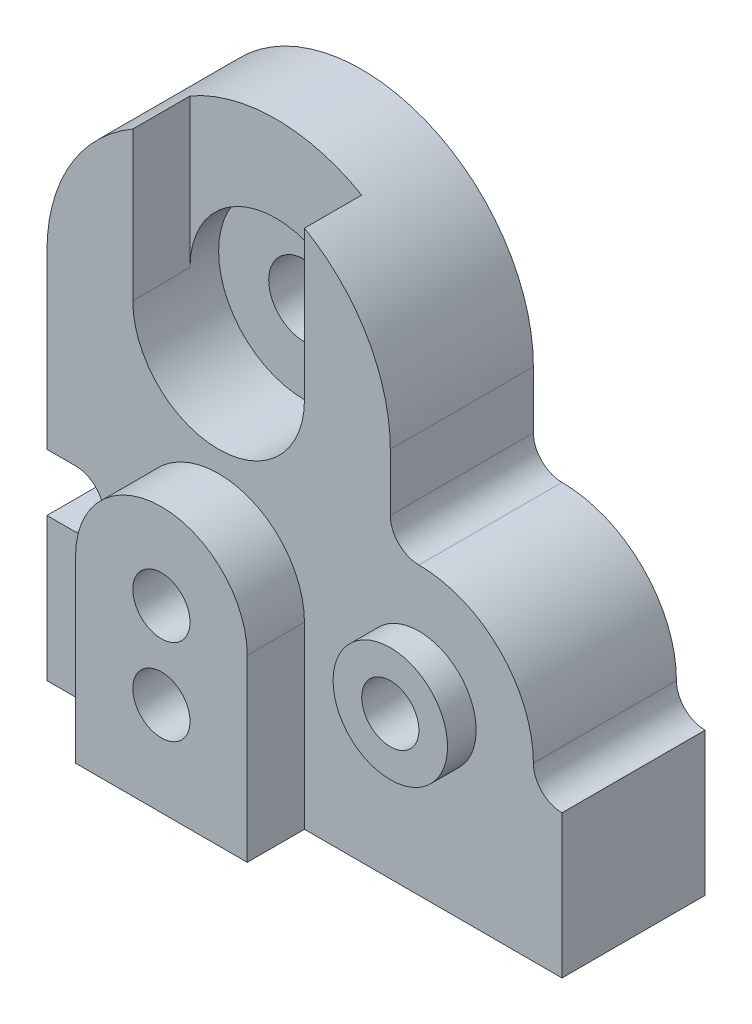
ISO-10303-21;
HEADER;
FILE_DESCRIPTION(('STEP AP214'),'2;1');
FILE_NAME('part.step','',(''),(''),'','','');
FILE_SCHEMA(('AUTOMOTIVE_DESIGN { 1 0 10303 214 1 1 1 1 }'));
ENDSEC;
DATA;
#1=APPLICATION_CONTEXT('core data for automotive mechanical design processes');
#2=APPLICATION_PROTOCOL_DEFINITION('international standard','automotive_design',2000,#1);
#3=PRODUCT_CONTEXT('',#1,'mechanical');
#4=PRODUCT('Part','Part','',(#3));
#5=PRODUCT_RELATED_PRODUCT_CATEGORY('part','',(#4));
#6=PRODUCT_DEFINITION_FORMATION('','',#4);
#7=PRODUCT_DEFINITION_CONTEXT('part definition',#1,'design');
#8=PRODUCT_DEFINITION('design','',#6,#7);
#9=PRODUCT_DEFINITION_SHAPE('','',#8);
#10=(LENGTH_UNIT() NAMED_UNIT(*) SI_UNIT(.MILLI.,.METRE.));
#11=(NAMED_UNIT(*) PLANE_ANGLE_UNIT() SI_UNIT($,.RADIAN.));
#12=(NAMED_UNIT(*) SI_UNIT($,.STERADIAN.) SOLID_ANGLE_UNIT());
#13=UNCERTAINTY_MEASURE_WITH_UNIT(LENGTH_MEASURE(1.E-05),#10,'distance_accuracy_value','');
#14=(GEOMETRIC_REPRESENTATION_CONTEXT(3) GLOBAL_UNCERTAINTY_ASSIGNED_CONTEXT((#13)) GLOBAL_UNIT_ASSIGNED_CONTEXT((#10,
#11,#12)) REPRESENTATION_CONTEXT('',''));
#15=CARTESIAN_POINT('',(0.,0.,0.));
#16=DIRECTION('',(0.,0.,1.));
#17=DIRECTION('',(1.,0.,0.));
#18=AXIS2_PLACEMENT_3D('',#15,#16,#17);
#19=CARTESIAN_POINT('',(6.,13.,5.));
#20=DIRECTION('',(0.,0.,-1.));
#21=DIRECTION('',(-1.,0.,0.));
#22=AXIS2_PLACEMENT_3D('',#19,#20,#21);
#23=CYLINDRICAL_SURFACE('',#22,1.25);
#24=CARTESIAN_POINT('',(6.,13.,-1.));
#25=DIRECTION('',(0.,0.,-1.));
#26=DIRECTION('',(-1.,0.,0.));
#27=AXIS2_PLACEMENT_3D('',#24,#25,#26);
#28=CIRCLE('',#27,1.25000000000001);
#29=CARTESIAN_POINT('',(4.74999999999999,13.,-1.));
#30=VERTEX_POINT('',#29);
#31=EDGE_CURVE('E354',#30,#30,#28,.T.);
#32=ORIENTED_EDGE('',*,*,#31,.T.);
#33=EDGE_LOOP('',(#32));
#34=FACE_BOUND('',#33,.T.);
#35=CARTESIAN_POINT('',(6.,13.,2.));
#36=DIRECTION('',(0.,0.,1.));
#37=DIRECTION('',(1.,0.,0.));
#38=AXIS2_PLACEMENT_3D('',#35,#36,#37);
#39=CIRCLE('',#38,1.25);
#40=CARTESIAN_POINT('',(7.25,13.,2.));
#41=VERTEX_POINT('',#40);
#42=EDGE_CURVE('E39',#41,#41,#39,.T.);
#43=ORIENTED_EDGE('',*,*,#42,.T.);
#44=EDGE_LOOP('',(#43));
#45=FACE_BOUND('',#44,.T.);
#46=ADVANCED_FACE('F35',(#34,#45),#23,.F.);
#47=CARTESIAN_POINT('',(1.,6.,5.));
#48=DIRECTION('',(0.,0.,-1.));
#49=DIRECTION('',(-1.,0.,0.));
#50=AXIS2_PLACEMENT_3D('',#47,#48,#49);
#51=CYLINDRICAL_SURFACE('',#50,0.5);
#52=CARTESIAN_POINT('',(1.,6.,0.));
#53=DIRECTION('',(0.,0.,1.));
#54=DIRECTION('',(1.,0.,0.));
#55=AXIS2_PLACEMENT_3D('',#52,#53,#54);
#56=CIRCLE('',#55,0.5);
#57=CARTESIAN_POINT('',(1.5,6.,0.));
#58=VERTEX_POINT('',#57);
#59=EDGE_CURVE('E222',#58,#58,#56,.T.);
#60=ORIENTED_EDGE('',*,*,#59,.F.);
#61=EDGE_LOOP('',(#60));
#62=FACE_BOUND('',#61,.T.);
#63=CARTESIAN_POINT('',(1.,6.,3.));
#64=DIRECTION('',(0.,0.,1.));
#65=DIRECTION('',(1.,0.,0.));
#66=AXIS2_PLACEMENT_3D('',#63,#64,#65);
#67=CIRCLE('',#66,0.5);
#68=CARTESIAN_POINT('',(1.5,6.,3.));
#69=VERTEX_POINT('',#68);
#70=EDGE_CURVE('E296',#69,#69,#67,.T.);
#71=ORIENTED_EDGE('',*,*,#70,.T.);
#72=EDGE_LOOP('',(#71));
#73=FACE_BOUND('',#72,.T.);
#74=ADVANCED_FACE('F447',(#62,#73),#51,.F.);
#75=CARTESIAN_POINT('',(18.,6.,0.));
#76=DIRECTION('',(0.,0.,-1.));
#77=DIRECTION('',(-1.,0.,0.));
#78=AXIS2_PLACEMENT_3D('',#75,#76,#77);
#79=PLANE('',#78);
#80=CARTESIAN_POINT('',(6.,3.26663723882795,0.));
#81=DIRECTION('',(0.,0.,1.));
#82=DIRECTION('',(1.,0.,0.));
#83=AXIS2_PLACEMENT_3D('',#80,#81,#82);
#84=CIRCLE('',#83,1.);
#85=CARTESIAN_POINT('',(7.,3.26663723882795,0.));
#86=VERTEX_POINT('',#85);
#87=EDGE_CURVE('E185',#86,#86,#84,.T.);
#88=ORIENTED_EDGE('',*,*,#87,.T.);
#89=EDGE_LOOP('',(#88));
#90=FACE_BOUND('',#89,.T.);
#91=DIRECTION('',(0.,-1.,0.));
#92=VECTOR('',#91,1.);
#93=CARTESIAN_POINT('',(0.,13.,0.));
#94=LINE('',#93,#92);
#95=CARTESIAN_POINT('',(0.,13.,0.));
#96=VERTEX_POINT('',#95);
#97=CARTESIAN_POINT('',(0.,0.,0.));
#98=VERTEX_POINT('',#97);
#99=EDGE_CURVE('E225',#96,#98,#94,.T.);
#100=ORIENTED_EDGE('',*,*,#99,.F.);
#101=CARTESIAN_POINT('',(6.,13.,0.));
#102=DIRECTION('',(0.,0.,1.));
#103=DIRECTION('',(1.,0.,0.));
#104=AXIS2_PLACEMENT_3D('',#101,#102,#103);
#105=CIRCLE('',#104,6.);
#106=CARTESIAN_POINT('',(12.,13.,0.));
#107=VERTEX_POINT('',#106);
#108=EDGE_CURVE('E262',#107,#96,#105,.T.);
#109=ORIENTED_EDGE('',*,*,#108,.F.);
#110=DIRECTION('',(0.,1.,0.));
#111=VECTOR('',#110,1.);
#112=CARTESIAN_POINT('',(12.,11.,0.));
#113=LINE('',#112,#111);
#114=CARTESIAN_POINT('',(12.,11.,0.));
#115=VERTEX_POINT('',#114);
#116=EDGE_CURVE('E260',#115,#107,#113,.T.);
#117=ORIENTED_EDGE('',*,*,#116,.F.);
#118=CARTESIAN_POINT('',(13.,11.,0.));
#119=DIRECTION('',(0.,0.,-1.));
#120=DIRECTION('',(-1.,0.,0.));
#121=AXIS2_PLACEMENT_3D('',#118,#119,#120);
#122=CIRCLE('',#121,1.);
#123=CARTESIAN_POINT('',(13.,10.,0.));
#124=VERTEX_POINT('',#123);
#125=EDGE_CURVE('E258',#124,#115,#122,.T.);
#126=ORIENTED_EDGE('',*,*,#125,.F.);
#127=CARTESIAN_POINT('',(13.,6.,0.));
#128=DIRECTION('',(0.,0.,1.));
#129=DIRECTION('',(1.,0.,0.));
#130=AXIS2_PLACEMENT_3D('',#127,#128,#129);
#131=CIRCLE('',#130,4.);
#132=CARTESIAN_POINT('',(17.,6.,0.));
#133=VERTEX_POINT('',#132);
#134=EDGE_CURVE('E256',#133,#124,#131,.T.);
#135=ORIENTED_EDGE('',*,*,#134,.F.);
#136=CARTESIAN_POINT('',(18.,6.,0.));
#137=DIRECTION('',(0.,0.,-1.));
#138=DIRECTION('',(-1.,0.,0.));
#139=AXIS2_PLACEMENT_3D('',#136,#137,#138);
#140=CIRCLE('',#139,1.);
#141=CARTESIAN_POINT('',(18.,5.,0.));
#142=VERTEX_POINT('',#141);
#143=EDGE_CURVE('E254',#142,#133,#140,.T.);
#144=ORIENTED_EDGE('',*,*,#143,.F.);
#145=DIRECTION('',(0.,1.,0.));
#146=VECTOR('',#145,1.);
#147=CARTESIAN_POINT('',(18.,0.,0.));
#148=LINE('',#147,#146);
#149=CARTESIAN_POINT('',(18.,0.,0.));
#150=VERTEX_POINT('',#149);
#151=EDGE_CURVE('E252',#150,#142,#148,.T.);
#152=ORIENTED_EDGE('',*,*,#151,.F.);
#153=DIRECTION('',(1.,0.,0.));
#154=VECTOR('',#153,1.);
#155=CARTESIAN_POINT('',(0.,0.,0.));
#156=LINE('',#155,#154);
#157=EDGE_CURVE('E250',#98,#150,#156,.T.);
#158=ORIENTED_EDGE('',*,*,#157,.F.);
#159=EDGE_LOOP('',(#100,#109,#117,#126,#135,#144,#152,#158));
#160=FACE_BOUND('',#159,.T.);
#161=ORIENTED_EDGE('',*,*,#59,.T.);
#162=EDGE_LOOP('',(#161));
#163=FACE_BOUND('',#162,.T.);
#164=CARTESIAN_POINT('',(13.,6.,0.));
#165=DIRECTION('',(0.,0.,-1.));
#166=DIRECTION('',(-1.,0.,0.));
#167=AXIS2_PLACEMENT_3D('',#164,#165,#166);
#168=CIRCLE('',#167,2.);
#169=CARTESIAN_POINT('',(11.,6.,0.));
#170=VERTEX_POINT('',#169);
#171=EDGE_CURVE('E215',#170,#170,#168,.T.);
#172=ORIENTED_EDGE('',*,*,#171,.F.);
#173=EDGE_LOOP('',(#172));
#174=FACE_BOUND('',#173,.T.);
#175=CARTESIAN_POINT('',(6.,13.,0.));
#176=DIRECTION('',(0.,0.,-1.));
#177=DIRECTION('',(-1.,0.,0.));
#178=AXIS2_PLACEMENT_3D('',#175,#176,#177);
#179=CIRCLE('',#178,3.);
#180=CARTESIAN_POINT('',(3.,13.,0.));
#181=VERTEX_POINT('',#180);
#182=EDGE_CURVE('E362',#181,#181,#179,.T.);
#183=ORIENTED_EDGE('',*,*,#182,.F.);
#184=EDGE_LOOP('',(#183));
#185=FACE_BOUND('',#184,.T.);
#186=ADVANCED_FACE('F321',(#90,#160,#163,#174,#185),#79,.T.);
#187=CARTESIAN_POINT('',(18.,6.,5.));
#188=DIRECTION('',(0.,0.,-1.));
#189=DIRECTION('',(-1.,0.,0.));
#190=AXIS2_PLACEMENT_3D('',#187,#188,#189);
#191=PLANE('',#190);
#192=CARTESIAN_POINT('',(1.,6.,5.));
#193=DIRECTION('',(0.,0.,1.));
#194=DIRECTION('',(1.,0.,0.));
#195=AXIS2_PLACEMENT_3D('',#192,#193,#194);
#196=CIRCLE('',#195,1.);
#197=CARTESIAN_POINT('',(1.,5.,5.));
#198=VERTEX_POINT('',#197);
#199=CARTESIAN_POINT('',(1.,7.,5.));
#200=VERTEX_POINT('',#199);
#201=EDGE_CURVE('E335',#198,#200,#196,.T.);
#202=ORIENTED_EDGE('',*,*,#201,.F.);
#203=DIRECTION('',(1.,0.,0.));
#204=VECTOR('',#203,1.);
#205=CARTESIAN_POINT('',(1.,5.,5.));
#206=LINE('',#205,#204);
#207=CARTESIAN_POINT('',(0.,5.,5.));
#208=VERTEX_POINT('',#207);
#209=EDGE_CURVE('E333',#208,#198,#206,.T.);
#210=ORIENTED_EDGE('',*,*,#209,.F.);
#211=DIRECTION('',(0.,-1.,0.));
#212=VECTOR('',#211,1.);
#213=CARTESIAN_POINT('',(0.,13.,5.));
#214=LINE('',#213,#212);
#215=CARTESIAN_POINT('',(0.,0.,5.));
#216=VERTEX_POINT('',#215);
#217=EDGE_CURVE('E230',#208,#216,#214,.T.);
#218=ORIENTED_EDGE('',*,*,#217,.T.);
#219=DIRECTION('',(1.,0.,0.));
#220=VECTOR('',#219,1.);
#221=CARTESIAN_POINT('',(0.,0.,5.));
#222=LINE('',#221,#220);
#223=CARTESIAN_POINT('',(3.,0.,5.));
#224=VERTEX_POINT('',#223);
#225=EDGE_CURVE('E231',#216,#224,#222,.T.);
#226=ORIENTED_EDGE('',*,*,#225,.T.);
#227=DIRECTION('',(0.,-1.,0.));
#228=VECTOR('',#227,1.);
#229=CARTESIAN_POINT('',(3.,6.26663723882795,5.));
#230=LINE('',#229,#228);
#231=CARTESIAN_POINT('',(3.,6.26663723882795,5.));
#232=VERTEX_POINT('',#231);
#233=EDGE_CURVE('E386',#232,#224,#230,.T.);
#234=ORIENTED_EDGE('',*,*,#233,.F.);
#235=CARTESIAN_POINT('',(6.,6.26663723882795,5.));
#236=DIRECTION('',(0.,0.,1.));
#237=DIRECTION('',(1.,0.,0.));
#238=AXIS2_PLACEMENT_3D('',#235,#236,#237);
#239=CIRCLE('',#238,3.);
#240=CARTESIAN_POINT('',(9.,6.26663723882795,5.));
#241=VERTEX_POINT('',#240);
#242=EDGE_CURVE('E59',#241,#232,#239,.T.);
#243=ORIENTED_EDGE('',*,*,#242,.F.);
#244=DIRECTION('',(0.,1.,0.));
#245=VECTOR('',#244,1.);
#246=CARTESIAN_POINT('',(9.,6.26663723882795,5.));
#247=LINE('',#246,#245);
#248=CARTESIAN_POINT('',(9.,0.,5.));
#249=VERTEX_POINT('',#248);
#250=EDGE_CURVE('E378',#249,#241,#247,.T.);
#251=ORIENTED_EDGE('',*,*,#250,.F.);
#252=CARTESIAN_POINT('',(18.,0.,5.));
#253=VERTEX_POINT('',#252);
#254=EDGE_CURVE('E229',#249,#253,#222,.T.);
#255=ORIENTED_EDGE('',*,*,#254,.T.);
#256=DIRECTION('',(0.,1.,0.));
#257=VECTOR('',#256,1.);
#258=CARTESIAN_POINT('',(18.,0.,5.));
#259=LINE('',#258,#257);
#260=CARTESIAN_POINT('',(18.,5.,5.));
#261=VERTEX_POINT('',#260);
#262=EDGE_CURVE('E233',#253,#261,#259,.T.);
#263=ORIENTED_EDGE('',*,*,#262,.T.);
#264=CARTESIAN_POINT('',(18.,6.,5.));
#265=DIRECTION('',(0.,0.,-1.));
#266=DIRECTION('',(-1.,0.,0.));
#267=AXIS2_PLACEMENT_3D('',#264,#265,#266);
#268=CIRCLE('',#267,1.);
#269=CARTESIAN_POINT('',(17.,6.,5.));
#270=VERTEX_POINT('',#269);
#271=EDGE_CURVE('E235',#261,#270,#268,.T.);
#272=ORIENTED_EDGE('',*,*,#271,.T.);
#273=CARTESIAN_POINT('',(13.,6.,5.));
#274=DIRECTION('',(0.,0.,1.));
#275=DIRECTION('',(1.,0.,0.));
#276=AXIS2_PLACEMENT_3D('',#273,#274,#275);
#277=CIRCLE('',#276,4.);
#278=CARTESIAN_POINT('',(13.,10.,5.));
#279=VERTEX_POINT('',#278);
#280=EDGE_CURVE('E237',#270,#279,#277,.T.);
#281=ORIENTED_EDGE('',*,*,#280,.T.);
#282=CARTESIAN_POINT('',(13.,11.,5.));
#283=DIRECTION('',(0.,0.,-1.));
#284=DIRECTION('',(-1.,0.,0.));
#285=AXIS2_PLACEMENT_3D('',#282,#283,#284);
#286=CIRCLE('',#285,1.);
#287=CARTESIAN_POINT('',(12.,11.,5.));
#288=VERTEX_POINT('',#287);
#289=EDGE_CURVE('E239',#279,#288,#286,.T.);
#290=ORIENTED_EDGE('',*,*,#289,.T.);
#291=DIRECTION('',(0.,1.,0.));
#292=VECTOR('',#291,1.);
#293=CARTESIAN_POINT('',(12.,11.,5.));
#294=LINE('',#293,#292);
#295=CARTESIAN_POINT('',(12.,13.,5.));
#296=VERTEX_POINT('',#295);
#297=EDGE_CURVE('E241',#288,#296,#294,.T.);
#298=ORIENTED_EDGE('',*,*,#297,.T.);
#299=CARTESIAN_POINT('',(6.,13.,5.));
#300=DIRECTION('',(0.,0.,1.));
#301=DIRECTION('',(1.,0.,0.));
#302=AXIS2_PLACEMENT_3D('',#299,#300,#301);
#303=CIRCLE('',#302,6.);
#304=CARTESIAN_POINT('',(9.,18.1961524227066,5.));
#305=VERTEX_POINT('',#304);
#306=EDGE_CURVE('E244',#296,#305,#303,.T.);
#307=ORIENTED_EDGE('',*,*,#306,.T.);
#308=DIRECTION('',(0.,1.,0.));
#309=VECTOR('',#308,1.);
#310=CARTESIAN_POINT('',(9.,13.,5.));
#311=LINE('',#310,#309);
#312=CARTESIAN_POINT('',(9.,13.,5.));
#313=VERTEX_POINT('',#312);
#314=EDGE_CURVE('E204',#313,#305,#311,.T.);
#315=ORIENTED_EDGE('',*,*,#314,.F.);
#316=CARTESIAN_POINT('',(6.,13.,5.));
#317=DIRECTION('',(0.,0.,1.));
#318=DIRECTION('',(1.,0.,0.));
#319=AXIS2_PLACEMENT_3D('',#316,#317,#318);
#320=CIRCLE('',#319,3.);
#321=CARTESIAN_POINT('',(3.,13.,5.));
#322=VERTEX_POINT('',#321);
#323=EDGE_CURVE('E192',#322,#313,#320,.T.);
#324=ORIENTED_EDGE('',*,*,#323,.F.);
#325=DIRECTION('',(0.,-1.,0.));
#326=VECTOR('',#325,1.);
#327=CARTESIAN_POINT('',(3.,13.,5.));
#328=LINE('',#327,#326);
#329=CARTESIAN_POINT('',(3.,18.1961524227066,5.));
#330=VERTEX_POINT('',#329);
#331=EDGE_CURVE('E201',#330,#322,#328,.T.);
#332=ORIENTED_EDGE('',*,*,#331,.F.);
#333=CARTESIAN_POINT('',(0.,13.,5.));
#334=VERTEX_POINT('',#333);
#335=EDGE_CURVE('E243',#330,#334,#303,.T.);
#336=ORIENTED_EDGE('',*,*,#335,.T.);
#337=CARTESIAN_POINT('',(0.,7.,5.));
#338=VERTEX_POINT('',#337);
#339=EDGE_CURVE('E226',#334,#338,#214,.T.);
#340=ORIENTED_EDGE('',*,*,#339,.T.);
#341=DIRECTION('',(-1.,0.,0.));
#342=VECTOR('',#341,1.);
#343=CARTESIAN_POINT('',(1.,7.,5.));
#344=LINE('',#343,#342);
#345=EDGE_CURVE('E311',#200,#338,#344,.T.);
#346=ORIENTED_EDGE('',*,*,#345,.F.);
#347=EDGE_LOOP('',(#202,#210,#218,#226,#234,#243,#251,#255,#263,#272,#281,#290,#298,#307,#315,
#324,#332,#336,#340,#346));
#348=FACE_BOUND('',#347,.T.);
#349=CARTESIAN_POINT('',(13.,6.,5.));
#350=DIRECTION('',(0.,0.,-1.));
#351=DIRECTION('',(-1.,0.,0.));
#352=AXIS2_PLACEMENT_3D('',#349,#350,#351);
#353=CIRCLE('',#352,2.);
#354=CARTESIAN_POINT('',(11.,6.,5.));
#355=VERTEX_POINT('',#354);
#356=EDGE_CURVE('E293',#355,#355,#353,.F.);
#357=ORIENTED_EDGE('',*,*,#356,.F.);
#358=EDGE_LOOP('',(#357));
#359=FACE_BOUND('',#358,.T.);
#360=ADVANCED_FACE('F309',(#348,#359),#191,.F.);
#361=CARTESIAN_POINT('',(13.,6.,5.));
#362=DIRECTION('',(0.,0.,-1.));
#363=DIRECTION('',(-1.,0.,0.));
#364=AXIS2_PLACEMENT_3D('',#361,#362,#363);
#365=CYLINDRICAL_SURFACE('',#364,1.);
#366=CARTESIAN_POINT('',(13.,6.,2.));
#367=DIRECTION('',(0.,0.,-1.));
#368=DIRECTION('',(-1.,0.,0.));
#369=AXIS2_PLACEMENT_3D('',#366,#367,#368);
#370=CIRCLE('',#369,1.);
#371=CARTESIAN_POINT('',(12.,6.,2.));
#372=VERTEX_POINT('',#371);
#373=EDGE_CURVE('E219',#372,#372,#370,.T.);
#374=ORIENTED_EDGE('',*,*,#373,.T.);
#375=EDGE_LOOP('',(#374));
#376=FACE_BOUND('',#375,.T.);
#377=CARTESIAN_POINT('',(13.,6.,6.));
#378=DIRECTION('',(0.,0.,1.));
#379=DIRECTION('',(1.,0.,0.));
#380=AXIS2_PLACEMENT_3D('',#377,#378,#379);
#381=CIRCLE('',#380,0.999999999999998);
#382=CARTESIAN_POINT('',(14.,6.,6.));
#383=VERTEX_POINT('',#382);
#384=EDGE_CURVE('E366',#383,#383,#381,.T.);
#385=ORIENTED_EDGE('',*,*,#384,.T.);
#386=EDGE_LOOP('',(#385));
#387=FACE_BOUND('',#386,.T.);
#388=ADVANCED_FACE('F460',(#376,#387),#365,.F.);
#389=CARTESIAN_POINT('',(0.,13.,5.));
#390=DIRECTION('',(1.,0.,0.));
#391=DIRECTION('',(0.,1.,0.));
#392=AXIS2_PLACEMENT_3D('',#389,#390,#391);
#393=PLANE('',#392);
#394=ORIENTED_EDGE('',*,*,#217,.F.);
#395=DIRECTION('',(0.,0.,-1.));
#396=VECTOR('',#395,1.);
#397=CARTESIAN_POINT('',(0.,5.,5.));
#398=LINE('',#397,#396);
#399=CARTESIAN_POINT('',(0.,5.,3.));
#400=VERTEX_POINT('',#399);
#401=EDGE_CURVE('E11',#208,#400,#398,.T.);
#402=ORIENTED_EDGE('',*,*,#401,.T.);
#403=DIRECTION('',(0.,-1.,0.));
#404=VECTOR('',#403,1.);
#405=CARTESIAN_POINT('',(0.,13.,3.));
#406=LINE('',#405,#404);
#407=CARTESIAN_POINT('',(0.,7.,3.));
#408=VERTEX_POINT('',#407);
#409=EDGE_CURVE('E299',#408,#400,#406,.T.);
#410=ORIENTED_EDGE('',*,*,#409,.F.);
#411=DIRECTION('',(0.,0.,1.));
#412=VECTOR('',#411,1.);
#413=CARTESIAN_POINT('',(0.,7.,5.));
#414=LINE('',#413,#412);
#415=EDGE_CURVE('E44',#408,#338,#414,.T.);
#416=ORIENTED_EDGE('',*,*,#415,.T.);
#417=ORIENTED_EDGE('',*,*,#339,.F.);
#418=DIRECTION('',(0.,0.,-1.));
#419=VECTOR('',#418,1.);
#420=CARTESIAN_POINT('',(0.,13.,5.));
#421=LINE('',#420,#419);
#422=EDGE_CURVE('E247',#334,#96,#421,.T.);
#423=ORIENTED_EDGE('',*,*,#422,.T.);
#424=ORIENTED_EDGE('',*,*,#99,.T.);
#425=DIRECTION('',(0.,0.,-1.));
#426=VECTOR('',#425,1.);
#427=CARTESIAN_POINT('',(0.,0.,5.));
#428=LINE('',#427,#426);
#429=EDGE_CURVE('E284',#216,#98,#428,.T.);
#430=ORIENTED_EDGE('',*,*,#429,.F.);
#431=EDGE_LOOP('',(#394,#402,#410,#416,#417,#423,#424,#430));
#432=FACE_BOUND('',#431,.T.);
#433=ADVANCED_FACE('F37',(#432),#393,.F.);
#434=CARTESIAN_POINT('',(0.,0.,5.));
#435=DIRECTION('',(0.,1.,0.));
#436=DIRECTION('',(0.,0.,1.));
#437=AXIS2_PLACEMENT_3D('',#434,#435,#436);
#438=PLANE('',#437);
#439=ORIENTED_EDGE('',*,*,#157,.T.);
#440=DIRECTION('',(0.,0.,-1.));
#441=VECTOR('',#440,1.);
#442=CARTESIAN_POINT('',(18.,0.,5.));
#443=LINE('',#442,#441);
#444=EDGE_CURVE('E281',#253,#150,#443,.T.);
#445=ORIENTED_EDGE('',*,*,#444,.F.);
#446=ORIENTED_EDGE('',*,*,#254,.F.);
#447=DIRECTION('',(0.,0.,-1.));
#448=VECTOR('',#447,1.);
#449=CARTESIAN_POINT('',(9.,0.,7.));
#450=LINE('',#449,#448);
#451=CARTESIAN_POINT('',(9.,0.,7.));
#452=VERTEX_POINT('',#451);
#453=EDGE_CURVE('E391',#452,#249,#450,.T.);
#454=ORIENTED_EDGE('',*,*,#453,.F.);
#455=DIRECTION('',(1.,0.,0.));
#456=VECTOR('',#455,1.);
#457=CARTESIAN_POINT('',(3.,0.,7.));
#458=LINE('',#457,#456);
#459=CARTESIAN_POINT('',(3.,0.,7.));
#460=VERTEX_POINT('',#459);
#461=EDGE_CURVE('E380',#460,#452,#458,.T.);
#462=ORIENTED_EDGE('',*,*,#461,.F.);
#463=DIRECTION('',(0.,0.,-1.));
#464=VECTOR('',#463,1.);
#465=CARTESIAN_POINT('',(3.,0.,7.));
#466=LINE('',#465,#464);
#467=EDGE_CURVE('E393',#460,#224,#466,.T.);
#468=ORIENTED_EDGE('',*,*,#467,.T.);
#469=ORIENTED_EDGE('',*,*,#225,.F.);
#470=ORIENTED_EDGE('',*,*,#429,.T.);
#471=EDGE_LOOP('',(#439,#445,#446,#454,#462,#468,#469,#470));
#472=FACE_BOUND('',#471,.T.);
#473=ADVANCED_FACE('F329',(#472),#438,.F.);
#474=CARTESIAN_POINT('',(18.,0.,5.));
#475=DIRECTION('',(-1.,0.,0.));
#476=DIRECTION('',(0.,0.,1.));
#477=AXIS2_PLACEMENT_3D('',#474,#475,#476);
#478=PLANE('',#477);
#479=ORIENTED_EDGE('',*,*,#151,.T.);
#480=DIRECTION('',(0.,0.,-1.));
#481=VECTOR('',#480,1.);
#482=CARTESIAN_POINT('',(18.,5.,5.));
#483=LINE('',#482,#481);
#484=EDGE_CURVE('E278',#261,#142,#483,.T.);
#485=ORIENTED_EDGE('',*,*,#484,.F.);
#486=ORIENTED_EDGE('',*,*,#262,.F.);
#487=ORIENTED_EDGE('',*,*,#444,.T.);
#488=EDGE_LOOP('',(#479,#485,#486,#487));
#489=FACE_BOUND('',#488,.T.);
#490=ADVANCED_FACE('F412',(#489),#478,.F.);
#491=CARTESIAN_POINT('',(18.,6.,5.));
#492=DIRECTION('',(0.,0.,-1.));
#493=DIRECTION('',(-1.,0.,0.));
#494=AXIS2_PLACEMENT_3D('',#491,#492,#493);
#495=CYLINDRICAL_SURFACE('',#494,1.);
#496=ORIENTED_EDGE('',*,*,#143,.T.);
#497=DIRECTION('',(0.,0.,-1.));
#498=VECTOR('',#497,1.);
#499=CARTESIAN_POINT('',(17.,6.,5.));
#500=LINE('',#499,#498);
#501=EDGE_CURVE('E275',#270,#133,#500,.T.);
#502=ORIENTED_EDGE('',*,*,#501,.F.);
#503=ORIENTED_EDGE('',*,*,#271,.F.);
#504=ORIENTED_EDGE('',*,*,#484,.T.);
#505=EDGE_LOOP('',(#496,#502,#503,#504));
#506=FACE_BOUND('',#505,.T.);
#507=ADVANCED_FACE('F418',(#506),#495,.F.);
#508=CARTESIAN_POINT('',(13.,6.,5.));
#509=DIRECTION('',(0.,0.,-1.));
#510=DIRECTION('',(-1.,0.,0.));
#511=AXIS2_PLACEMENT_3D('',#508,#509,#510);
#512=CYLINDRICAL_SURFACE('',#511,4.);
#513=ORIENTED_EDGE('',*,*,#134,.T.);
#514=DIRECTION('',(0.,0.,-1.));
#515=VECTOR('',#514,1.);
#516=CARTESIAN_POINT('',(13.,10.,5.));
#517=LINE('',#516,#515);
#518=EDGE_CURVE('E272',#279,#124,#517,.T.);
#519=ORIENTED_EDGE('',*,*,#518,.F.);
#520=ORIENTED_EDGE('',*,*,#280,.F.);
#521=ORIENTED_EDGE('',*,*,#501,.T.);
#522=EDGE_LOOP('',(#513,#519,#520,#521));
#523=FACE_BOUND('',#522,.T.);
#524=ADVANCED_FACE('F421',(#523),#512,.T.);
#525=CARTESIAN_POINT('',(13.,11.,5.));
#526=DIRECTION('',(0.,0.,-1.));
#527=DIRECTION('',(-1.,0.,0.));
#528=AXIS2_PLACEMENT_3D('',#525,#526,#527);
#529=CYLINDRICAL_SURFACE('',#528,1.);
#530=ORIENTED_EDGE('',*,*,#125,.T.);
#531=DIRECTION('',(0.,0.,-1.));
#532=VECTOR('',#531,1.);
#533=CARTESIAN_POINT('',(12.,11.,5.));
#534=LINE('',#533,#532);
#535=EDGE_CURVE('E269',#288,#115,#534,.T.);
#536=ORIENTED_EDGE('',*,*,#535,.F.);
#537=ORIENTED_EDGE('',*,*,#289,.F.);
#538=ORIENTED_EDGE('',*,*,#518,.T.);
#539=EDGE_LOOP('',(#530,#536,#537,#538));
#540=FACE_BOUND('',#539,.T.);
#541=ADVANCED_FACE('F426',(#540),#529,.F.);
#542=CARTESIAN_POINT('',(12.,11.,5.));
#543=DIRECTION('',(-1.,0.,0.));
#544=DIRECTION('',(0.,0.,1.));
#545=AXIS2_PLACEMENT_3D('',#542,#543,#544);
#546=PLANE('',#545);
#547=ORIENTED_EDGE('',*,*,#116,.T.);
#548=DIRECTION('',(0.,0.,-1.));
#549=VECTOR('',#548,1.);
#550=CARTESIAN_POINT('',(12.,13.,5.));
#551=LINE('',#550,#549);
#552=EDGE_CURVE('E266',#296,#107,#551,.T.);
#553=ORIENTED_EDGE('',*,*,#552,.F.);
#554=ORIENTED_EDGE('',*,*,#297,.F.);
#555=ORIENTED_EDGE('',*,*,#535,.T.);
#556=EDGE_LOOP('',(#547,#553,#554,#555));
#557=FACE_BOUND('',#556,.T.);
#558=ADVANCED_FACE('F431',(#557),#546,.F.);
#559=CARTESIAN_POINT('',(6.,13.,5.));
#560=DIRECTION('',(0.,0.,-1.));
#561=DIRECTION('',(-1.,0.,0.));
#562=AXIS2_PLACEMENT_3D('',#559,#560,#561);
#563=CYLINDRICAL_SURFACE('',#562,6.);
#564=ORIENTED_EDGE('',*,*,#335,.F.);
#565=DIRECTION('',(0.,0.,-1.));
#566=VECTOR('',#565,1.);
#567=CARTESIAN_POINT('',(3.,18.1961524227066,5.));
#568=LINE('',#567,#566);
#569=CARTESIAN_POINT('',(3.,18.1961524227066,3.));
#570=VERTEX_POINT('',#569);
#571=EDGE_CURVE('E290',#330,#570,#568,.T.);
#572=ORIENTED_EDGE('',*,*,#571,.T.);
#573=CARTESIAN_POINT('',(6.,13.,3.));
#574=DIRECTION('',(0.,0.,1.));
#575=DIRECTION('',(1.,0.,0.));
#576=AXIS2_PLACEMENT_3D('',#573,#574,#575);
#577=CIRCLE('',#576,6.);
#578=CARTESIAN_POINT('',(9.,18.1961524227066,3.));
#579=VERTEX_POINT('',#578);
#580=EDGE_CURVE('E212',#579,#570,#577,.T.);
#581=ORIENTED_EDGE('',*,*,#580,.F.);
#582=DIRECTION('',(0.,0.,-1.));
#583=VECTOR('',#582,1.);
#584=CARTESIAN_POINT('',(9.,18.1961524227066,5.));
#585=LINE('',#584,#583);
#586=EDGE_CURVE('E199',#579,#305,#585,.F.);
#587=ORIENTED_EDGE('',*,*,#586,.T.);
#588=ORIENTED_EDGE('',*,*,#306,.F.);
#589=ORIENTED_EDGE('',*,*,#552,.T.);
#590=ORIENTED_EDGE('',*,*,#108,.T.);
#591=ORIENTED_EDGE('',*,*,#422,.F.);
#592=EDGE_LOOP('',(#564,#572,#581,#587,#588,#589,#590,#591));
#593=FACE_BOUND('',#592,.T.);
#594=ADVANCED_FACE('F316',(#593),#563,.T.);
#595=CARTESIAN_POINT('',(13.,6.,2.));
#596=DIRECTION('',(0.,0.,-1.));
#597=DIRECTION('',(-1.,0.,0.));
#598=AXIS2_PLACEMENT_3D('',#595,#596,#597);
#599=CYLINDRICAL_SURFACE('',#598,2.);
#600=CARTESIAN_POINT('',(13.,6.,2.));
#601=DIRECTION('',(0.,0.,-1.));
#602=DIRECTION('',(-1.,0.,0.));
#603=AXIS2_PLACEMENT_3D('',#600,#601,#602);
#604=CIRCLE('',#603,2.);
#605=CARTESIAN_POINT('',(11.,6.,2.));
#606=VERTEX_POINT('',#605);
#607=EDGE_CURVE('E216',#606,#606,#604,.T.);
#608=ORIENTED_EDGE('',*,*,#607,.F.);
#609=EDGE_LOOP('',(#608));
#610=FACE_BOUND('',#609,.T.);
#611=ORIENTED_EDGE('',*,*,#171,.T.);
#612=EDGE_LOOP('',(#611));
#613=FACE_BOUND('',#612,.T.);
#614=ADVANCED_FACE('F442',(#610,#613),#599,.F.);
#615=CARTESIAN_POINT('',(13.,6.,2.));
#616=DIRECTION('',(0.,0.,-1.));
#617=DIRECTION('',(-1.,0.,0.));
#618=AXIS2_PLACEMENT_3D('',#615,#616,#617);
#619=PLANE('',#618);
#620=ORIENTED_EDGE('',*,*,#373,.F.);
#621=EDGE_LOOP('',(#620));
#622=FACE_BOUND('',#621,.T.);
#623=ORIENTED_EDGE('',*,*,#607,.T.);
#624=EDGE_LOOP('',(#623));
#625=FACE_BOUND('',#624,.T.);
#626=ADVANCED_FACE('F435',(#622,#625),#619,.T.);
#627=CARTESIAN_POINT('',(3.,13.,3.));
#628=DIRECTION('',(-1.,0.,0.));
#629=DIRECTION('',(0.,0.,1.));
#630=AXIS2_PLACEMENT_3D('',#627,#628,#629);
#631=PLANE('',#630);
#632=ORIENTED_EDGE('',*,*,#331,.T.);
#633=DIRECTION('',(0.,0.,1.));
#634=VECTOR('',#633,1.);
#635=CARTESIAN_POINT('',(3.,13.,3.));
#636=LINE('',#635,#634);
#637=CARTESIAN_POINT('',(3.,13.,3.));
#638=VERTEX_POINT('',#637);
#639=EDGE_CURVE('E195',#638,#322,#636,.T.);
#640=ORIENTED_EDGE('',*,*,#639,.F.);
#641=DIRECTION('',(0.,-1.,0.));
#642=VECTOR('',#641,1.);
#643=CARTESIAN_POINT('',(3.,13.,3.));
#644=LINE('',#643,#642);
#645=EDGE_CURVE('E180',#570,#638,#644,.T.);
#646=ORIENTED_EDGE('',*,*,#645,.F.);
#647=ORIENTED_EDGE('',*,*,#571,.F.);
#648=EDGE_LOOP('',(#632,#640,#646,#647));
#649=FACE_BOUND('',#648,.T.);
#650=ADVANCED_FACE('F433',(#649),#631,.F.);
#651=CARTESIAN_POINT('',(9.,13.,3.));
#652=DIRECTION('',(1.,0.,0.));
#653=DIRECTION('',(0.,0.,-1.));
#654=AXIS2_PLACEMENT_3D('',#651,#652,#653);
#655=PLANE('',#654);
#656=DIRECTION('',(0.,1.,0.));
#657=VECTOR('',#656,1.);
#658=CARTESIAN_POINT('',(9.,13.,3.));
#659=LINE('',#658,#657);
#660=CARTESIAN_POINT('',(9.,13.,3.));
#661=VERTEX_POINT('',#660);
#662=EDGE_CURVE('E177',#661,#579,#659,.T.);
#663=ORIENTED_EDGE('',*,*,#662,.F.);
#664=DIRECTION('',(0.,0.,1.));
#665=VECTOR('',#664,1.);
#666=CARTESIAN_POINT('',(9.,13.,3.));
#667=LINE('',#666,#665);
#668=EDGE_CURVE('E188',#661,#313,#667,.T.);
#669=ORIENTED_EDGE('',*,*,#668,.T.);
#670=ORIENTED_EDGE('',*,*,#314,.T.);
#671=ORIENTED_EDGE('',*,*,#586,.F.);
#672=EDGE_LOOP('',(#663,#669,#670,#671));
#673=FACE_BOUND('',#672,.T.);
#674=ADVANCED_FACE('F197',(#673),#655,.F.);
#675=CARTESIAN_POINT('',(6.,13.,3.));
#676=DIRECTION('',(0.,0.,1.));
#677=DIRECTION('',(1.,0.,0.));
#678=AXIS2_PLACEMENT_3D('',#675,#676,#677);
#679=PLANE('',#678);
#680=CARTESIAN_POINT('',(6.,13.,3.));
#681=DIRECTION('',(0.,0.,1.));
#682=DIRECTION('',(1.,0.,0.));
#683=AXIS2_PLACEMENT_3D('',#680,#681,#682);
#684=CIRCLE('',#683,3.);
#685=EDGE_CURVE('E173',#661,#638,#684,.T.);
#686=ORIENTED_EDGE('',*,*,#685,.F.);
#687=ORIENTED_EDGE('',*,*,#662,.T.);
#688=ORIENTED_EDGE('',*,*,#580,.T.);
#689=ORIENTED_EDGE('',*,*,#645,.T.);
#690=EDGE_LOOP('',(#686,#687,#688,#689));
#691=FACE_BOUND('',#690,.T.);
#692=ADVANCED_FACE('F175',(#691),#679,.T.);
#693=CARTESIAN_POINT('',(6.,13.,3.));
#694=DIRECTION('',(0.,0.,1.));
#695=DIRECTION('',(1.,0.,0.));
#696=AXIS2_PLACEMENT_3D('',#693,#694,#695);
#697=CYLINDRICAL_SURFACE('',#696,3.);
#698=ORIENTED_EDGE('',*,*,#323,.T.);
#699=ORIENTED_EDGE('',*,*,#668,.F.);
#700=ORIENTED_EDGE('',*,*,#685,.T.);
#701=ORIENTED_EDGE('',*,*,#639,.T.);
#702=EDGE_LOOP('',(#698,#699,#700,#701));
#703=FACE_BOUND('',#702,.T.);
#704=CARTESIAN_POINT('',(6.,13.,2.));
#705=DIRECTION('',(0.,0.,1.));
#706=DIRECTION('',(1.,0.,0.));
#707=AXIS2_PLACEMENT_3D('',#704,#705,#706);
#708=CIRCLE('',#707,3.);
#709=CARTESIAN_POINT('',(9.,13.,2.));
#710=VERTEX_POINT('',#709);
#711=EDGE_CURVE('E184',#710,#710,#708,.T.);
#712=ORIENTED_EDGE('',*,*,#711,.F.);
#713=EDGE_LOOP('',(#712));
#714=FACE_BOUND('',#713,.T.);
#715=ADVANCED_FACE('F189',(#703,#714),#697,.F.);
#716=CARTESIAN_POINT('',(6.,6.26663723882795,7.));
#717=DIRECTION('',(0.,0.,-1.));
#718=DIRECTION('',(-1.,0.,0.));
#719=AXIS2_PLACEMENT_3D('',#716,#717,#718);
#720=CYLINDRICAL_SURFACE('',#719,3.);
#721=ORIENTED_EDGE('',*,*,#242,.T.);
#722=DIRECTION('',(0.,0.,-1.));
#723=VECTOR('',#722,1.);
#724=CARTESIAN_POINT('',(3.,6.26663723882795,7.));
#725=LINE('',#724,#723);
#726=CARTESIAN_POINT('',(3.,6.26663723882795,7.));
#727=VERTEX_POINT('',#726);
#728=EDGE_CURVE('E207',#727,#232,#725,.T.);
#729=ORIENTED_EDGE('',*,*,#728,.F.);
#730=CARTESIAN_POINT('',(6.,6.26663723882795,7.));
#731=DIRECTION('',(0.,0.,1.));
#732=DIRECTION('',(1.,0.,0.));
#733=AXIS2_PLACEMENT_3D('',#730,#731,#732);
#734=CIRCLE('',#733,3.);
#735=CARTESIAN_POINT('',(9.,6.26663723882795,7.));
#736=VERTEX_POINT('',#735);
#737=EDGE_CURVE('E374',#736,#727,#734,.T.);
#738=ORIENTED_EDGE('',*,*,#737,.F.);
#739=DIRECTION('',(0.,0.,-1.));
#740=VECTOR('',#739,1.);
#741=CARTESIAN_POINT('',(9.,6.26663723882795,7.));
#742=LINE('',#741,#740);
#743=EDGE_CURVE('E384',#736,#241,#742,.T.);
#744=ORIENTED_EDGE('',*,*,#743,.T.);
#745=EDGE_LOOP('',(#721,#729,#738,#744));
#746=FACE_BOUND('',#745,.T.);
#747=ADVANCED_FACE('F402',(#746),#720,.T.);
#748=CARTESIAN_POINT('',(3.,6.26663723882795,7.));
#749=DIRECTION('',(1.,0.,0.));
#750=DIRECTION('',(0.,1.,0.));
#751=AXIS2_PLACEMENT_3D('',#748,#749,#750);
#752=PLANE('',#751);
#753=ORIENTED_EDGE('',*,*,#233,.T.);
#754=ORIENTED_EDGE('',*,*,#467,.F.);
#755=DIRECTION('',(0.,-1.,0.));
#756=VECTOR('',#755,1.);
#757=CARTESIAN_POINT('',(3.,6.26663723882795,7.));
#758=LINE('',#757,#756);
#759=EDGE_CURVE('E377',#727,#460,#758,.T.);
#760=ORIENTED_EDGE('',*,*,#759,.F.);
#761=ORIENTED_EDGE('',*,*,#728,.T.);
#762=EDGE_LOOP('',(#753,#754,#760,#761));
#763=FACE_BOUND('',#762,.T.);
#764=ADVANCED_FACE('F399',(#763),#752,.F.);
#765=CARTESIAN_POINT('',(9.,6.26663723882795,7.));
#766=DIRECTION('',(-1.,0.,0.));
#767=DIRECTION('',(0.,0.,1.));
#768=AXIS2_PLACEMENT_3D('',#765,#766,#767);
#769=PLANE('',#768);
#770=ORIENTED_EDGE('',*,*,#250,.T.);
#771=ORIENTED_EDGE('',*,*,#743,.F.);
#772=DIRECTION('',(0.,1.,0.));
#773=VECTOR('',#772,1.);
#774=CARTESIAN_POINT('',(9.,6.26663723882795,7.));
#775=LINE('',#774,#773);
#776=EDGE_CURVE('E382',#452,#736,#775,.T.);
#777=ORIENTED_EDGE('',*,*,#776,.F.);
#778=ORIENTED_EDGE('',*,*,#453,.T.);
#779=EDGE_LOOP('',(#770,#771,#777,#778));
#780=FACE_BOUND('',#779,.T.);
#781=ADVANCED_FACE('F406',(#780),#769,.F.);
#782=CARTESIAN_POINT('',(6.,6.26663723882795,7.));
#783=DIRECTION('',(0.,0.,1.));
#784=DIRECTION('',(1.,0.,0.));
#785=AXIS2_PLACEMENT_3D('',#782,#783,#784);
#786=PLANE('',#785);
#787=CARTESIAN_POINT('',(6.,6.26663723882795,7.));
#788=DIRECTION('',(0.,0.,1.));
#789=DIRECTION('',(1.,0.,0.));
#790=AXIS2_PLACEMENT_3D('',#787,#788,#789);
#791=CIRCLE('',#790,1.);
#792=CARTESIAN_POINT('',(7.,6.26663723882795,7.));
#793=VERTEX_POINT('',#792);
#794=EDGE_CURVE('E355',#793,#793,#791,.T.);
#795=ORIENTED_EDGE('',*,*,#794,.F.);
#796=EDGE_LOOP('',(#795));
#797=FACE_BOUND('',#796,.T.);
#798=CARTESIAN_POINT('',(6.,3.26663723882795,7.));
#799=DIRECTION('',(0.,0.,1.));
#800=DIRECTION('',(1.,0.,0.));
#801=AXIS2_PLACEMENT_3D('',#798,#799,#800);
#802=CIRCLE('',#801,1.);
#803=CARTESIAN_POINT('',(7.,3.26663723882795,7.));
#804=VERTEX_POINT('',#803);
#805=EDGE_CURVE('E350',#804,#804,#802,.T.);
#806=ORIENTED_EDGE('',*,*,#805,.F.);
#807=EDGE_LOOP('',(#806));
#808=FACE_BOUND('',#807,.T.);
#809=ORIENTED_EDGE('',*,*,#737,.T.);
#810=ORIENTED_EDGE('',*,*,#759,.T.);
#811=ORIENTED_EDGE('',*,*,#461,.T.);
#812=ORIENTED_EDGE('',*,*,#776,.T.);
#813=EDGE_LOOP('',(#809,#810,#811,#812));
#814=FACE_BOUND('',#813,.T.);
#815=ADVANCED_FACE('F503',(#797,#808,#814),#786,.T.);
#816=CARTESIAN_POINT('',(13.,6.,6.));
#817=DIRECTION('',(0.,0.,1.));
#818=DIRECTION('',(1.,0.,0.));
#819=AXIS2_PLACEMENT_3D('',#816,#817,#818);
#820=PLANE('',#819);
#821=CARTESIAN_POINT('',(13.,6.,6.));
#822=DIRECTION('',(0.,0.,1.));
#823=DIRECTION('',(1.,0.,0.));
#824=AXIS2_PLACEMENT_3D('',#821,#822,#823);
#825=CIRCLE('',#824,2.);
#826=CARTESIAN_POINT('',(15.,6.,6.));
#827=VERTEX_POINT('',#826);
#828=EDGE_CURVE('E371',#827,#827,#825,.T.);
#829=ORIENTED_EDGE('',*,*,#828,.T.);
#830=EDGE_LOOP('',(#829));
#831=FACE_BOUND('',#830,.T.);
#832=ORIENTED_EDGE('',*,*,#384,.F.);
#833=EDGE_LOOP('',(#832));
#834=FACE_BOUND('',#833,.T.);
#835=ADVANCED_FACE('F506',(#831,#834),#820,.T.);
#836=CARTESIAN_POINT('',(13.,6.,6.));
#837=DIRECTION('',(0.,0.,-1.));
#838=DIRECTION('',(-1.,0.,0.));
#839=AXIS2_PLACEMENT_3D('',#836,#837,#838);
#840=CYLINDRICAL_SURFACE('',#839,2.);
#841=ORIENTED_EDGE('',*,*,#828,.F.);
#842=EDGE_LOOP('',(#841));
#843=FACE_BOUND('',#842,.T.);
#844=ORIENTED_EDGE('',*,*,#356,.T.);
#845=EDGE_LOOP('',(#844));
#846=FACE_BOUND('',#845,.T.);
#847=ADVANCED_FACE('F508',(#843,#846),#840,.T.);
#848=CARTESIAN_POINT('',(6.,13.,-1.));
#849=DIRECTION('',(0.,0.,1.));
#850=DIRECTION('',(1.,0.,0.));
#851=AXIS2_PLACEMENT_3D('',#848,#849,#850);
#852=PLANE('',#851);
#853=CARTESIAN_POINT('',(6.,13.,-1.));
#854=DIRECTION('',(0.,0.,-1.));
#855=DIRECTION('',(1.,0.,0.));
#856=AXIS2_PLACEMENT_3D('',#853,#854,#855);
#857=CIRCLE('',#856,3.);
#858=CARTESIAN_POINT('',(9.,13.,-1.));
#859=VERTEX_POINT('',#858);
#860=EDGE_CURVE('E363',#859,#859,#857,.T.);
#861=ORIENTED_EDGE('',*,*,#860,.T.);
#862=EDGE_LOOP('',(#861));
#863=FACE_BOUND('',#862,.T.);
#864=ORIENTED_EDGE('',*,*,#31,.F.);
#865=EDGE_LOOP('',(#864));
#866=FACE_BOUND('',#865,.T.);
#867=ADVANCED_FACE('F511',(#863,#866),#852,.F.);
#868=CARTESIAN_POINT('',(6.,13.,-1.));
#869=DIRECTION('',(0.,0.,1.));
#870=DIRECTION('',(1.,0.,0.));
#871=AXIS2_PLACEMENT_3D('',#868,#869,#870);
#872=CYLINDRICAL_SURFACE('',#871,3.);
#873=ORIENTED_EDGE('',*,*,#182,.T.);
#874=EDGE_LOOP('',(#873));
#875=FACE_BOUND('',#874,.T.);
#876=ORIENTED_EDGE('',*,*,#860,.F.);
#877=EDGE_LOOP('',(#876));
#878=FACE_BOUND('',#877,.T.);
#879=ADVANCED_FACE('F516',(#875,#878),#872,.T.);
#880=CARTESIAN_POINT('',(6.,3.26663723882795,4.));
#881=DIRECTION('',(0.,0.,1.));
#882=DIRECTION('',(1.,0.,0.));
#883=AXIS2_PLACEMENT_3D('',#880,#881,#882);
#884=CYLINDRICAL_SURFACE('',#883,1.);
#885=ORIENTED_EDGE('',*,*,#805,.T.);
#886=EDGE_LOOP('',(#885));
#887=FACE_BOUND('',#886,.T.);
#888=ORIENTED_EDGE('',*,*,#87,.F.);
#889=EDGE_LOOP('',(#888));
#890=FACE_BOUND('',#889,.T.);
#891=ADVANCED_FACE('F519',(#887,#890),#884,.F.);
#892=CARTESIAN_POINT('',(6.,6.26663723882795,4.));
#893=DIRECTION('',(0.,0.,1.));
#894=DIRECTION('',(1.,0.,0.));
#895=AXIS2_PLACEMENT_3D('',#892,#893,#894);
#896=CYLINDRICAL_SURFACE('',#895,1.);
#897=CARTESIAN_POINT('',(6.,6.26663723882795,4.));
#898=DIRECTION('',(0.,0.,1.));
#899=DIRECTION('',(1.,0.,0.));
#900=AXIS2_PLACEMENT_3D('',#897,#898,#899);
#901=CIRCLE('',#900,1.);
#902=CARTESIAN_POINT('',(7.,6.26663723882795,4.));
#903=VERTEX_POINT('',#902);
#904=EDGE_CURVE('E351',#903,#903,#901,.T.);
#905=ORIENTED_EDGE('',*,*,#904,.F.);
#906=EDGE_LOOP('',(#905));
#907=FACE_BOUND('',#906,.T.);
#908=ORIENTED_EDGE('',*,*,#794,.T.);
#909=EDGE_LOOP('',(#908));
#910=FACE_BOUND('',#909,.T.);
#911=ADVANCED_FACE('F526',(#907,#910),#896,.F.);
#912=CARTESIAN_POINT('',(6.,6.26663723882795,4.));
#913=DIRECTION('',(0.,0.,1.));
#914=DIRECTION('',(1.,0.,0.));
#915=AXIS2_PLACEMENT_3D('',#912,#913,#914);
#916=PLANE('',#915);
#917=ORIENTED_EDGE('',*,*,#904,.T.);
#918=EDGE_LOOP('',(#917));
#919=FACE_BOUND('',#918,.T.);
#920=ADVANCED_FACE('F530',(#919),#916,.T.);
#921=CARTESIAN_POINT('',(1.,5.,3.));
#922=DIRECTION('',(0.,-1.,0.));
#923=DIRECTION('',(0.,0.,-1.));
#924=AXIS2_PLACEMENT_3D('',#921,#922,#923);
#925=PLANE('',#924);
#926=ORIENTED_EDGE('',*,*,#209,.T.);
#927=DIRECTION('',(0.,0.,1.));
#928=VECTOR('',#927,1.);
#929=CARTESIAN_POINT('',(1.,5.,3.));
#930=LINE('',#929,#928);
#931=CARTESIAN_POINT('',(1.,5.,3.));
#932=VERTEX_POINT('',#931);
#933=EDGE_CURVE('E300',#932,#198,#930,.T.);
#934=ORIENTED_EDGE('',*,*,#933,.F.);
#935=DIRECTION('',(1.,0.,0.));
#936=VECTOR('',#935,1.);
#937=CARTESIAN_POINT('',(1.,5.,3.));
#938=LINE('',#937,#936);
#939=EDGE_CURVE('E348',#400,#932,#938,.T.);
#940=ORIENTED_EDGE('',*,*,#939,.F.);
#941=ORIENTED_EDGE('',*,*,#401,.F.);
#942=EDGE_LOOP('',(#926,#934,#940,#941));
#943=FACE_BOUND('',#942,.T.);
#944=ADVANCED_FACE('F534',(#943),#925,.F.);
#945=CARTESIAN_POINT('',(1.,7.,3.));
#946=DIRECTION('',(0.,1.,0.));
#947=DIRECTION('',(0.,0.,1.));
#948=AXIS2_PLACEMENT_3D('',#945,#946,#947);
#949=PLANE('',#948);
#950=DIRECTION('',(-1.,0.,0.));
#951=VECTOR('',#950,1.);
#952=CARTESIAN_POINT('',(1.,7.,3.));
#953=LINE('',#952,#951);
#954=CARTESIAN_POINT('',(1.,7.,3.));
#955=VERTEX_POINT('',#954);
#956=EDGE_CURVE('E51',#955,#408,#953,.T.);
#957=ORIENTED_EDGE('',*,*,#956,.F.);
#958=DIRECTION('',(0.,0.,1.));
#959=VECTOR('',#958,1.);
#960=CARTESIAN_POINT('',(1.,7.,3.));
#961=LINE('',#960,#959);
#962=EDGE_CURVE('E346',#955,#200,#961,.T.);
#963=ORIENTED_EDGE('',*,*,#962,.T.);
#964=ORIENTED_EDGE('',*,*,#345,.T.);
#965=ORIENTED_EDGE('',*,*,#415,.F.);
#966=EDGE_LOOP('',(#957,#963,#964,#965));
#967=FACE_BOUND('',#966,.T.);
#968=ADVANCED_FACE('F542',(#967),#949,.F.);
#969=CARTESIAN_POINT('',(1.,6.,3.));
#970=DIRECTION('',(0.,0.,1.));
#971=DIRECTION('',(1.,0.,0.));
#972=AXIS2_PLACEMENT_3D('',#969,#970,#971);
#973=PLANE('',#972);
#974=ORIENTED_EDGE('',*,*,#70,.F.);
#975=EDGE_LOOP('',(#974));
#976=FACE_BOUND('',#975,.T.);
#977=ORIENTED_EDGE('',*,*,#409,.T.);
#978=ORIENTED_EDGE('',*,*,#939,.T.);
#979=CARTESIAN_POINT('',(1.,6.,3.));
#980=DIRECTION('',(0.,0.,1.));
#981=DIRECTION('',(1.,0.,0.));
#982=AXIS2_PLACEMENT_3D('',#979,#980,#981);
#983=CIRCLE('',#982,1.);
#984=EDGE_CURVE('E339',#932,#955,#983,.T.);
#985=ORIENTED_EDGE('',*,*,#984,.T.);
#986=ORIENTED_EDGE('',*,*,#956,.T.);
#987=EDGE_LOOP('',(#977,#978,#985,#986));
#988=FACE_BOUND('',#987,.T.);
#989=ADVANCED_FACE('F540',(#976,#988),#973,.T.);
#990=CARTESIAN_POINT('',(1.,6.,3.));
#991=DIRECTION('',(0.,0.,1.));
#992=DIRECTION('',(1.,0.,0.));
#993=AXIS2_PLACEMENT_3D('',#990,#991,#992);
#994=CYLINDRICAL_SURFACE('',#993,1.);
#995=ORIENTED_EDGE('',*,*,#201,.T.);
#996=ORIENTED_EDGE('',*,*,#962,.F.);
#997=ORIENTED_EDGE('',*,*,#984,.F.);
#998=ORIENTED_EDGE('',*,*,#933,.T.);
#999=EDGE_LOOP('',(#995,#996,#997,#998));
#1000=FACE_BOUND('',#999,.T.);
#1001=ADVANCED_FACE('F536',(#1000),#994,.F.);
#1002=CARTESIAN_POINT('',(6.,13.,2.));
#1003=DIRECTION('',(0.,0.,1.));
#1004=DIRECTION('',(1.,0.,0.));
#1005=AXIS2_PLACEMENT_3D('',#1002,#1003,#1004);
#1006=PLANE('',#1005);
#1007=ORIENTED_EDGE('',*,*,#42,.F.);
#1008=EDGE_LOOP('',(#1007));
#1009=FACE_BOUND('',#1008,.T.);
#1010=ORIENTED_EDGE('',*,*,#711,.T.);
#1011=EDGE_LOOP('',(#1010));
#1012=FACE_BOUND('',#1011,.T.);
#1013=ADVANCED_FACE('F539',(#1009,#1012),#1006,.T.);
#1014=CLOSED_SHELL('',(#46,#74,#186,#360,#388,#433,#473,#490,#507,#524,#541,#558,#594,#614,#626,
#650,#674,#692,#715,#747,#764,#781,#815,#835,#847,#867,#879,#891,#911,#920,#944,#968,#989,#1001,#1013));
#1015=MANIFOLD_SOLID_BREP('B2',#1014);
#1016=ADVANCED_BREP_SHAPE_REPRESENTATION('',(#18,#1015),#14);
#1017=SHAPE_DEFINITION_REPRESENTATION(#9,#1016);
ENDSEC;
END-ISO-10303-21;
